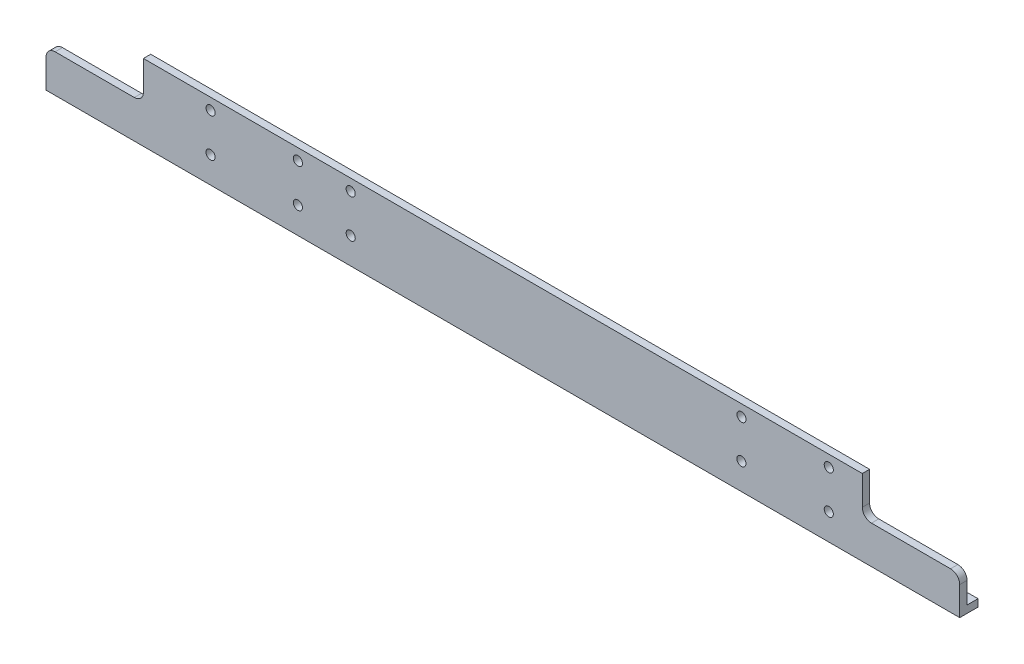
ISO-10303-21;
HEADER;
FILE_DESCRIPTION(('STEP AP214'),'2;1');
FILE_NAME('part.step','',(''),(''),'','','');
FILE_SCHEMA(('AUTOMOTIVE_DESIGN { 1 0 10303 214 1 1 1 1 }'));
ENDSEC;
DATA;
#1=APPLICATION_CONTEXT('core data for automotive mechanical design processes');
#2=APPLICATION_PROTOCOL_DEFINITION('international standard','automotive_design',2000,#1);
#3=PRODUCT_CONTEXT('',#1,'mechanical');
#4=PRODUCT('Part','Part','',(#3));
#5=PRODUCT_RELATED_PRODUCT_CATEGORY('part','',(#4));
#6=PRODUCT_DEFINITION_FORMATION('','',#4);
#7=PRODUCT_DEFINITION_CONTEXT('part definition',#1,'design');
#8=PRODUCT_DEFINITION('design','',#6,#7);
#9=PRODUCT_DEFINITION_SHAPE('','',#8);
#10=(LENGTH_UNIT() NAMED_UNIT(*) SI_UNIT(.MILLI.,.METRE.));
#11=(NAMED_UNIT(*) PLANE_ANGLE_UNIT() SI_UNIT($,.RADIAN.));
#12=(NAMED_UNIT(*) SI_UNIT($,.STERADIAN.) SOLID_ANGLE_UNIT());
#13=UNCERTAINTY_MEASURE_WITH_UNIT(LENGTH_MEASURE(1.E-05),#10,'distance_accuracy_value','');
#14=(GEOMETRIC_REPRESENTATION_CONTEXT(3) GLOBAL_UNCERTAINTY_ASSIGNED_CONTEXT((#13)) GLOBAL_UNIT_ASSIGNED_CONTEXT((#10,
#11,#12)) REPRESENTATION_CONTEXT('',''));
#15=CARTESIAN_POINT('',(0.,0.,0.));
#16=DIRECTION('',(0.,0.,1.));
#17=DIRECTION('',(1.,0.,0.));
#18=AXIS2_PLACEMENT_3D('',#15,#16,#17);
#19=CARTESIAN_POINT('',(-190.5,0.,0.));
#20=DIRECTION('',(-1.,0.,0.));
#21=DIRECTION('',(0.,0.,1.));
#22=AXIS2_PLACEMENT_3D('',#19,#20,#21);
#23=PLANE('',#22);
#24=DIRECTION('',(0.,-1.,0.));
#25=VECTOR('',#24,1.);
#26=CARTESIAN_POINT('',(-190.5,7.62,-7.62));
#27=LINE('',#26,#25);
#28=CARTESIAN_POINT('',(-190.5,3.048,-7.62));
#29=VERTEX_POINT('',#28);
#30=CARTESIAN_POINT('',(-190.5,0.,-7.62));
#31=VERTEX_POINT('',#30);
#32=EDGE_CURVE('E62',#29,#31,#27,.T.);
#33=ORIENTED_EDGE('',*,*,#32,.T.);
#34=DIRECTION('',(0.,0.,-1.));
#35=VECTOR('',#34,1.);
#36=CARTESIAN_POINT('',(-190.5,0.,0.));
#37=LINE('',#36,#35);
#38=CARTESIAN_POINT('',(-190.5,0.,0.));
#39=VERTEX_POINT('',#38);
#40=EDGE_CURVE('E175',#39,#31,#37,.T.);
#41=ORIENTED_EDGE('',*,*,#40,.F.);
#42=DIRECTION('',(0.,-1.,0.));
#43=VECTOR('',#42,1.);
#44=CARTESIAN_POINT('',(-190.5,0.,0.));
#45=LINE('',#44,#43);
#46=CARTESIAN_POINT('',(-190.5,11.938,0.));
#47=VERTEX_POINT('',#46);
#48=EDGE_CURVE('E173',#47,#39,#45,.T.);
#49=ORIENTED_EDGE('',*,*,#48,.F.);
#50=DIRECTION('',(0.,0.,1.));
#51=VECTOR('',#50,1.);
#52=CARTESIAN_POINT('',(-190.5,11.938,-31.75));
#53=LINE('',#52,#51);
#54=CARTESIAN_POINT('',(-190.5,11.938,-3.048));
#55=VERTEX_POINT('',#54);
#56=EDGE_CURVE('E213',#47,#55,#53,.F.);
#57=ORIENTED_EDGE('',*,*,#56,.T.);
#58=DIRECTION('',(0.,1.,0.));
#59=VECTOR('',#58,1.);
#60=CARTESIAN_POINT('',(-190.5,3.048,-3.048));
#61=LINE('',#60,#59);
#62=CARTESIAN_POINT('',(-190.5,3.048,-3.048));
#63=VERTEX_POINT('',#62);
#64=EDGE_CURVE('E181',#63,#55,#61,.T.);
#65=ORIENTED_EDGE('',*,*,#64,.F.);
#66=DIRECTION('',(0.,0.,1.));
#67=VECTOR('',#66,1.);
#68=CARTESIAN_POINT('',(-190.5,3.048,-3.048));
#69=LINE('',#68,#67);
#70=EDGE_CURVE('E179',#29,#63,#69,.T.);
#71=ORIENTED_EDGE('',*,*,#70,.F.);
#72=EDGE_LOOP('',(#33,#41,#49,#57,#65,#71));
#73=FACE_BOUND('',#72,.T.);
#74=ADVANCED_FACE('F46',(#73),#23,.T.);
#75=CARTESIAN_POINT('',(190.5,0.,0.));
#76=DIRECTION('',(-1.,0.,0.));
#77=DIRECTION('',(0.,0.,1.));
#78=AXIS2_PLACEMENT_3D('',#75,#76,#77);
#79=PLANE('',#78);
#80=DIRECTION('',(0.,0.,-1.));
#81=VECTOR('',#80,1.);
#82=CARTESIAN_POINT('',(190.5,0.,0.));
#83=LINE('',#82,#81);
#84=CARTESIAN_POINT('',(190.5,0.,0.));
#85=VERTEX_POINT('',#84);
#86=CARTESIAN_POINT('',(190.5,0.,-7.62));
#87=VERTEX_POINT('',#86);
#88=EDGE_CURVE('E159',#85,#87,#83,.T.);
#89=ORIENTED_EDGE('',*,*,#88,.T.);
#90=DIRECTION('',(0.,-1.,0.));
#91=VECTOR('',#90,1.);
#92=CARTESIAN_POINT('',(190.5,7.62,-7.62));
#93=LINE('',#92,#91);
#94=CARTESIAN_POINT('',(190.5,3.048,-7.62));
#95=VERTEX_POINT('',#94);
#96=EDGE_CURVE('E147',#95,#87,#93,.T.);
#97=ORIENTED_EDGE('',*,*,#96,.F.);
#98=DIRECTION('',(0.,0.,1.));
#99=VECTOR('',#98,1.);
#100=CARTESIAN_POINT('',(190.5,3.048,-3.048));
#101=LINE('',#100,#99);
#102=CARTESIAN_POINT('',(190.5,3.048,-3.048));
#103=VERTEX_POINT('',#102);
#104=EDGE_CURVE('E156',#95,#103,#101,.T.);
#105=ORIENTED_EDGE('',*,*,#104,.T.);
#106=DIRECTION('',(0.,1.,0.));
#107=VECTOR('',#106,1.);
#108=CARTESIAN_POINT('',(190.5,3.048,-3.048));
#109=LINE('',#108,#107);
#110=CARTESIAN_POINT('',(190.5,11.938,-3.048));
#111=VERTEX_POINT('',#110);
#112=EDGE_CURVE('E165',#103,#111,#109,.T.);
#113=ORIENTED_EDGE('',*,*,#112,.T.);
#114=DIRECTION('',(0.,0.,1.));
#115=VECTOR('',#114,1.);
#116=CARTESIAN_POINT('',(190.5,11.938,-31.75));
#117=LINE('',#116,#115);
#118=CARTESIAN_POINT('',(190.5,11.938,0.));
#119=VERTEX_POINT('',#118);
#120=EDGE_CURVE('E193',#119,#111,#117,.F.);
#121=ORIENTED_EDGE('',*,*,#120,.F.);
#122=DIRECTION('',(0.,-1.,0.));
#123=VECTOR('',#122,1.);
#124=CARTESIAN_POINT('',(190.5,0.,0.));
#125=LINE('',#124,#123);
#126=EDGE_CURVE('E169',#119,#85,#125,.T.);
#127=ORIENTED_EDGE('',*,*,#126,.T.);
#128=EDGE_LOOP('',(#89,#97,#105,#113,#121,#127));
#129=FACE_BOUND('',#128,.T.);
#130=ADVANCED_FACE('F154',(#129),#79,.F.);
#131=CARTESIAN_POINT('',(190.5,0.,0.));
#132=DIRECTION('',(0.,0.,-1.));
#133=DIRECTION('',(-1.,0.,0.));
#134=AXIS2_PLACEMENT_3D('',#131,#132,#133);
#135=PLANE('',#134);
#136=CARTESIAN_POINT('',(-63.4479999999987,27.,0.));
#137=DIRECTION('',(0.,0.,1.));
#138=DIRECTION('',(1.,0.,0.));
#139=AXIS2_PLACEMENT_3D('',#136,#137,#138);
#140=CIRCLE('',#139,1.89865);
#141=CARTESIAN_POINT('',(-61.5493499999987,27.,0.));
#142=VERTEX_POINT('',#141);
#143=EDGE_CURVE('E390',#142,#142,#140,.T.);
#144=ORIENTED_EDGE('',*,*,#143,.F.);
#145=EDGE_LOOP('',(#144));
#146=FACE_BOUND('',#145,.T.);
#147=CARTESIAN_POINT('',(-63.4479999999987,11.,0.));
#148=DIRECTION('',(0.,0.,1.));
#149=DIRECTION('',(1.,0.,0.));
#150=AXIS2_PLACEMENT_3D('',#147,#148,#149);
#151=CIRCLE('',#150,1.89865);
#152=CARTESIAN_POINT('',(-61.5493499999987,11.,0.));
#153=VERTEX_POINT('',#152);
#154=EDGE_CURVE('E394',#153,#153,#151,.T.);
#155=ORIENTED_EDGE('',*,*,#154,.F.);
#156=EDGE_LOOP('',(#155));
#157=FACE_BOUND('',#156,.T.);
#158=CARTESIAN_POINT('',(135.900000000001,27.,0.));
#159=DIRECTION('',(0.,0.,1.));
#160=DIRECTION('',(1.,0.,0.));
#161=AXIS2_PLACEMENT_3D('',#158,#159,#160);
#162=CIRCLE('',#161,1.89864999999997);
#163=CARTESIAN_POINT('',(137.798650000001,27.,0.));
#164=VERTEX_POINT('',#163);
#165=EDGE_CURVE('E273',#164,#164,#162,.T.);
#166=ORIENTED_EDGE('',*,*,#165,.F.);
#167=EDGE_LOOP('',(#166));
#168=FACE_BOUND('',#167,.T.);
#169=CARTESIAN_POINT('',(135.900000000001,11.,0.));
#170=DIRECTION('',(0.,0.,1.));
#171=DIRECTION('',(1.,0.,0.));
#172=AXIS2_PLACEMENT_3D('',#169,#170,#171);
#173=CIRCLE('',#172,1.89864999999997);
#174=CARTESIAN_POINT('',(137.798650000001,11.,0.));
#175=VERTEX_POINT('',#174);
#176=EDGE_CURVE('E202',#175,#175,#173,.T.);
#177=ORIENTED_EDGE('',*,*,#176,.F.);
#178=EDGE_LOOP('',(#177));
#179=FACE_BOUND('',#178,.T.);
#180=CARTESIAN_POINT('',(99.5,27.,0.));
#181=DIRECTION('',(0.,0.,1.));
#182=DIRECTION('',(1.,0.,0.));
#183=AXIS2_PLACEMENT_3D('',#180,#181,#182);
#184=CIRCLE('',#183,1.89864999999999);
#185=CARTESIAN_POINT('',(101.39865,27.,0.));
#186=VERTEX_POINT('',#185);
#187=EDGE_CURVE('E198',#186,#186,#184,.T.);
#188=ORIENTED_EDGE('',*,*,#187,.F.);
#189=EDGE_LOOP('',(#188));
#190=FACE_BOUND('',#189,.T.);
#191=CARTESIAN_POINT('',(99.468,11.0000000000001,0.));
#192=DIRECTION('',(0.,0.,1.));
#193=DIRECTION('',(1.,0.,0.));
#194=AXIS2_PLACEMENT_3D('',#191,#192,#193);
#195=CIRCLE('',#194,1.89864999999999);
#196=CARTESIAN_POINT('',(101.36665,11.0000000000001,0.));
#197=VERTEX_POINT('',#196);
#198=EDGE_CURVE('E197',#197,#197,#195,.T.);
#199=ORIENTED_EDGE('',*,*,#198,.F.);
#200=EDGE_LOOP('',(#199));
#201=FACE_BOUND('',#200,.T.);
#202=CARTESIAN_POINT('',(-121.867999999999,27.,0.));
#203=DIRECTION('',(0.,0.,1.));
#204=DIRECTION('',(1.,0.,0.));
#205=AXIS2_PLACEMENT_3D('',#202,#203,#204);
#206=CIRCLE('',#205,1.89864999999999);
#207=CARTESIAN_POINT('',(-119.969349999999,27.,0.));
#208=VERTEX_POINT('',#207);
#209=EDGE_CURVE('E288',#208,#208,#206,.T.);
#210=ORIENTED_EDGE('',*,*,#209,.F.);
#211=EDGE_LOOP('',(#210));
#212=FACE_BOUND('',#211,.T.);
#213=CARTESIAN_POINT('',(-121.867999999999,11.,0.));
#214=DIRECTION('',(0.,0.,1.));
#215=DIRECTION('',(1.,0.,0.));
#216=AXIS2_PLACEMENT_3D('',#213,#214,#215);
#217=CIRCLE('',#216,1.89864999999999);
#218=CARTESIAN_POINT('',(-119.969349999999,11.,0.));
#219=VERTEX_POINT('',#218);
#220=EDGE_CURVE('E294',#219,#219,#217,.T.);
#221=ORIENTED_EDGE('',*,*,#220,.F.);
#222=EDGE_LOOP('',(#221));
#223=FACE_BOUND('',#222,.T.);
#224=CARTESIAN_POINT('',(-85.468,11.,0.));
#225=DIRECTION('',(0.,0.,1.));
#226=DIRECTION('',(1.,0.,0.));
#227=AXIS2_PLACEMENT_3D('',#224,#225,#226);
#228=CIRCLE('',#227,1.89864999999999);
#229=CARTESIAN_POINT('',(-83.56935,11.,0.));
#230=VERTEX_POINT('',#229);
#231=EDGE_CURVE('E300',#230,#230,#228,.T.);
#232=ORIENTED_EDGE('',*,*,#231,.F.);
#233=EDGE_LOOP('',(#232));
#234=FACE_BOUND('',#233,.T.);
#235=CARTESIAN_POINT('',(-85.468,27.,0.));
#236=DIRECTION('',(0.,0.,1.));
#237=DIRECTION('',(1.,0.,0.));
#238=AXIS2_PLACEMENT_3D('',#235,#236,#237);
#239=CIRCLE('',#238,1.89864999999999);
#240=CARTESIAN_POINT('',(-83.56935,27.,0.));
#241=VERTEX_POINT('',#240);
#242=EDGE_CURVE('E306',#241,#241,#239,.T.);
#243=ORIENTED_EDGE('',*,*,#242,.F.);
#244=EDGE_LOOP('',(#243));
#245=FACE_BOUND('',#244,.T.);
#246=DIRECTION('',(1.,0.,0.));
#247=VECTOR('',#246,1.);
#248=CARTESIAN_POINT('',(-153.686999999998,15.748,0.));
#249=LINE('',#248,#247);
#250=CARTESIAN_POINT('',(-186.69,15.748,0.));
#251=VERTEX_POINT('',#250);
#252=CARTESIAN_POINT('',(-153.686999999998,15.748,0.));
#253=VERTEX_POINT('',#252);
#254=EDGE_CURVE('E239',#251,#253,#249,.T.);
#255=ORIENTED_EDGE('',*,*,#254,.F.);
#256=CARTESIAN_POINT('',(-186.69,11.938,0.));
#257=DIRECTION('',(0.,0.,-1.));
#258=DIRECTION('',(-1.,0.,0.));
#259=AXIS2_PLACEMENT_3D('',#256,#257,#258);
#260=CIRCLE('',#259,3.81);
#261=EDGE_CURVE('E322',#47,#251,#260,.T.);
#262=ORIENTED_EDGE('',*,*,#261,.F.);
#263=ORIENTED_EDGE('',*,*,#48,.T.);
#264=DIRECTION('',(-1.,0.,0.));
#265=VECTOR('',#264,1.);
#266=CARTESIAN_POINT('',(190.5,0.,0.));
#267=LINE('',#266,#265);
#268=EDGE_CURVE('E190',#85,#39,#267,.T.);
#269=ORIENTED_EDGE('',*,*,#268,.F.);
#270=ORIENTED_EDGE('',*,*,#126,.F.);
#271=CARTESIAN_POINT('',(186.69,11.938,0.));
#272=DIRECTION('',(0.,0.,-1.));
#273=DIRECTION('',(1.,0.,0.));
#274=AXIS2_PLACEMENT_3D('',#271,#272,#273);
#275=CIRCLE('',#274,3.81);
#276=CARTESIAN_POINT('',(186.69,15.748,0.));
#277=VERTEX_POINT('',#276);
#278=EDGE_CURVE('E250',#277,#119,#275,.T.);
#279=ORIENTED_EDGE('',*,*,#278,.F.);
#280=DIRECTION('',(1.,0.,0.));
#281=VECTOR('',#280,1.);
#282=CARTESIAN_POINT('',(153.686999999998,15.748,0.));
#283=LINE('',#282,#281);
#284=CARTESIAN_POINT('',(153.686999999998,15.748,0.));
#285=VERTEX_POINT('',#284);
#286=EDGE_CURVE('E258',#285,#277,#283,.T.);
#287=ORIENTED_EDGE('',*,*,#286,.F.);
#288=CARTESIAN_POINT('',(153.686999999998,19.558,0.));
#289=DIRECTION('',(0.,0.,1.));
#290=DIRECTION('',(1.,0.,0.));
#291=AXIS2_PLACEMENT_3D('',#288,#289,#290);
#292=CIRCLE('',#291,3.81);
#293=CARTESIAN_POINT('',(149.876999999998,19.558,0.));
#294=VERTEX_POINT('',#293);
#295=EDGE_CURVE('E255',#294,#285,#292,.T.);
#296=ORIENTED_EDGE('',*,*,#295,.F.);
#297=DIRECTION('',(0.,-1.,0.));
#298=VECTOR('',#297,1.);
#299=CARTESIAN_POINT('',(149.876999999998,41.148,0.));
#300=LINE('',#299,#298);
#301=CARTESIAN_POINT('',(149.876999999998,31.75,0.));
#302=VERTEX_POINT('',#301);
#303=EDGE_CURVE('E252',#302,#294,#300,.T.);
#304=ORIENTED_EDGE('',*,*,#303,.F.);
#305=DIRECTION('',(-1.,0.,0.));
#306=VECTOR('',#305,1.);
#307=CARTESIAN_POINT('',(190.5,31.75,0.));
#308=LINE('',#307,#306);
#309=CARTESIAN_POINT('',(-149.876999999998,31.75,0.));
#310=VERTEX_POINT('',#309);
#311=EDGE_CURVE('E167',#302,#310,#308,.T.);
#312=ORIENTED_EDGE('',*,*,#311,.T.);
#313=DIRECTION('',(0.,1.,0.));
#314=VECTOR('',#313,1.);
#315=CARTESIAN_POINT('',(-149.876999999998,41.148,0.));
#316=LINE('',#315,#314);
#317=CARTESIAN_POINT('',(-149.876999999998,19.558,0.));
#318=VERTEX_POINT('',#317);
#319=EDGE_CURVE('E244',#318,#310,#316,.T.);
#320=ORIENTED_EDGE('',*,*,#319,.F.);
#321=CARTESIAN_POINT('',(-153.686999999998,19.558,0.));
#322=DIRECTION('',(0.,0.,1.));
#323=DIRECTION('',(-1.,0.,0.));
#324=AXIS2_PLACEMENT_3D('',#321,#322,#323);
#325=CIRCLE('',#324,3.81);
#326=EDGE_CURVE('E331',#253,#318,#325,.T.);
#327=ORIENTED_EDGE('',*,*,#326,.F.);
#328=EDGE_LOOP('',(#255,#262,#263,#269,#270,#279,#287,#296,#304,#312,#320,#327));
#329=FACE_BOUND('',#328,.T.);
#330=ADVANCED_FACE('F48',(#146,#157,#168,#179,#190,#201,#212,#223,#234,#245,#329),#135,.F.);
#331=CARTESIAN_POINT('',(190.5,0.,0.));
#332=DIRECTION('',(0.,1.,0.));
#333=DIRECTION('',(0.,0.,1.));
#334=AXIS2_PLACEMENT_3D('',#331,#332,#333);
#335=PLANE('',#334);
#336=ORIENTED_EDGE('',*,*,#40,.T.);
#337=DIRECTION('',(1.,0.,0.));
#338=VECTOR('',#337,1.);
#339=CARTESIAN_POINT('',(190.5,0.,-7.62));
#340=LINE('',#339,#338);
#341=EDGE_CURVE('E317',#31,#87,#340,.T.);
#342=ORIENTED_EDGE('',*,*,#341,.T.);
#343=ORIENTED_EDGE('',*,*,#88,.F.);
#344=ORIENTED_EDGE('',*,*,#268,.T.);
#345=EDGE_LOOP('',(#336,#342,#343,#344));
#346=FACE_BOUND('',#345,.T.);
#347=ADVANCED_FACE('F316',(#346),#335,.F.);
#348=CARTESIAN_POINT('',(190.5,3.048,-3.048));
#349=DIRECTION('',(0.,-1.,0.));
#350=DIRECTION('',(0.,0.,-1.));
#351=AXIS2_PLACEMENT_3D('',#348,#349,#350);
#352=PLANE('',#351);
#353=ORIENTED_EDGE('',*,*,#104,.F.);
#354=DIRECTION('',(-1.,0.,0.));
#355=VECTOR('',#354,1.);
#356=CARTESIAN_POINT('',(190.5,3.048,-7.62));
#357=LINE('',#356,#355);
#358=EDGE_CURVE('E13',#95,#29,#357,.T.);
#359=ORIENTED_EDGE('',*,*,#358,.T.);
#360=ORIENTED_EDGE('',*,*,#70,.T.);
#361=DIRECTION('',(-1.,0.,0.));
#362=VECTOR('',#361,1.);
#363=CARTESIAN_POINT('',(190.5,3.048,-3.048));
#364=LINE('',#363,#362);
#365=EDGE_CURVE('E163',#103,#63,#364,.T.);
#366=ORIENTED_EDGE('',*,*,#365,.F.);
#367=EDGE_LOOP('',(#353,#359,#360,#366));
#368=FACE_BOUND('',#367,.T.);
#369=ADVANCED_FACE('F161',(#368),#352,.F.);
#370=CARTESIAN_POINT('',(190.5,3.048,-3.048));
#371=DIRECTION('',(0.,0.,1.));
#372=DIRECTION('',(1.,0.,0.));
#373=AXIS2_PLACEMENT_3D('',#370,#371,#372);
#374=PLANE('',#373);
#375=CARTESIAN_POINT('',(-63.4479999999987,27.,-3.048));
#376=DIRECTION('',(0.,0.,1.));
#377=DIRECTION('',(1.,0.,0.));
#378=AXIS2_PLACEMENT_3D('',#375,#376,#377);
#379=CIRCLE('',#378,1.89865);
#380=CARTESIAN_POINT('',(-61.5493499999987,27.,-3.048));
#381=VERTEX_POINT('',#380);
#382=EDGE_CURVE('E543',#381,#381,#379,.T.);
#383=ORIENTED_EDGE('',*,*,#382,.T.);
#384=EDGE_LOOP('',(#383));
#385=FACE_BOUND('',#384,.T.);
#386=CARTESIAN_POINT('',(-63.4479999999987,11.,-3.048));
#387=DIRECTION('',(0.,0.,1.));
#388=DIRECTION('',(1.,0.,0.));
#389=AXIS2_PLACEMENT_3D('',#386,#387,#388);
#390=CIRCLE('',#389,1.89865);
#391=CARTESIAN_POINT('',(-61.5493499999987,11.,-3.048));
#392=VERTEX_POINT('',#391);
#393=EDGE_CURVE('E50',#392,#392,#390,.T.);
#394=ORIENTED_EDGE('',*,*,#393,.T.);
#395=EDGE_LOOP('',(#394));
#396=FACE_BOUND('',#395,.T.);
#397=ORIENTED_EDGE('',*,*,#64,.T.);
#398=CARTESIAN_POINT('',(-186.69,11.938,-3.048));
#399=DIRECTION('',(0.,0.,1.));
#400=DIRECTION('',(1.,0.,0.));
#401=AXIS2_PLACEMENT_3D('',#398,#399,#400);
#402=CIRCLE('',#401,3.81);
#403=CARTESIAN_POINT('',(-186.69,15.748,-3.048));
#404=VERTEX_POINT('',#403);
#405=EDGE_CURVE('E69',#55,#404,#402,.F.);
#406=ORIENTED_EDGE('',*,*,#405,.T.);
#407=DIRECTION('',(1.,0.,0.));
#408=VECTOR('',#407,1.);
#409=CARTESIAN_POINT('',(190.5,15.7479999999999,-3.048));
#410=LINE('',#409,#408);
#411=CARTESIAN_POINT('',(-153.686999999998,15.748,-3.048));
#412=VERTEX_POINT('',#411);
#413=EDGE_CURVE('E218',#404,#412,#410,.T.);
#414=ORIENTED_EDGE('',*,*,#413,.T.);
#415=CARTESIAN_POINT('',(-153.686999999998,19.558,-3.048));
#416=DIRECTION('',(0.,0.,1.));
#417=DIRECTION('',(1.,0.,0.));
#418=AXIS2_PLACEMENT_3D('',#415,#416,#417);
#419=CIRCLE('',#418,3.81);
#420=CARTESIAN_POINT('',(-149.876999999998,19.558,-3.048));
#421=VERTEX_POINT('',#420);
#422=EDGE_CURVE('E55',#412,#421,#419,.T.);
#423=ORIENTED_EDGE('',*,*,#422,.T.);
#424=DIRECTION('',(0.,1.,0.));
#425=VECTOR('',#424,1.);
#426=CARTESIAN_POINT('',(-149.876999999998,3.048,-3.048));
#427=LINE('',#426,#425);
#428=CARTESIAN_POINT('',(-149.876999999998,31.75,-3.048));
#429=VERTEX_POINT('',#428);
#430=EDGE_CURVE('E227',#421,#429,#427,.T.);
#431=ORIENTED_EDGE('',*,*,#430,.T.);
#432=DIRECTION('',(-1.,0.,0.));
#433=VECTOR('',#432,1.);
#434=CARTESIAN_POINT('',(190.5,31.75,-3.048));
#435=LINE('',#434,#433);
#436=CARTESIAN_POINT('',(149.876999999998,31.75,-3.048));
#437=VERTEX_POINT('',#436);
#438=EDGE_CURVE('E186',#437,#429,#435,.T.);
#439=ORIENTED_EDGE('',*,*,#438,.F.);
#440=DIRECTION('',(0.,-1.,0.));
#441=VECTOR('',#440,1.);
#442=CARTESIAN_POINT('',(149.876999999998,3.048,-3.048));
#443=LINE('',#442,#441);
#444=CARTESIAN_POINT('',(149.876999999998,19.558,-3.048));
#445=VERTEX_POINT('',#444);
#446=EDGE_CURVE('E270',#437,#445,#443,.T.);
#447=ORIENTED_EDGE('',*,*,#446,.T.);
#448=CARTESIAN_POINT('',(153.686999999998,19.558,-3.048));
#449=DIRECTION('',(0.,0.,1.));
#450=DIRECTION('',(1.,0.,0.));
#451=AXIS2_PLACEMENT_3D('',#448,#449,#450);
#452=CIRCLE('',#451,3.81);
#453=CARTESIAN_POINT('',(153.686999999998,15.748,-3.048));
#454=VERTEX_POINT('',#453);
#455=EDGE_CURVE('E207',#445,#454,#452,.T.);
#456=ORIENTED_EDGE('',*,*,#455,.T.);
#457=DIRECTION('',(1.,0.,0.));
#458=VECTOR('',#457,1.);
#459=CARTESIAN_POINT('',(190.5,15.748,-3.048));
#460=LINE('',#459,#458);
#461=CARTESIAN_POINT('',(186.69,15.748,-3.048));
#462=VERTEX_POINT('',#461);
#463=EDGE_CURVE('E210',#454,#462,#460,.T.);
#464=ORIENTED_EDGE('',*,*,#463,.T.);
#465=CARTESIAN_POINT('',(186.69,11.938,-3.048));
#466=DIRECTION('',(0.,0.,1.));
#467=DIRECTION('',(1.,0.,0.));
#468=AXIS2_PLACEMENT_3D('',#465,#466,#467);
#469=CIRCLE('',#468,3.81);
#470=EDGE_CURVE('E264',#462,#111,#469,.F.);
#471=ORIENTED_EDGE('',*,*,#470,.T.);
#472=ORIENTED_EDGE('',*,*,#112,.F.);
#473=ORIENTED_EDGE('',*,*,#365,.T.);
#474=EDGE_LOOP('',(#397,#406,#414,#423,#431,#439,#447,#456,#464,#471,#472,#473));
#475=FACE_BOUND('',#474,.T.);
#476=CARTESIAN_POINT('',(135.900000000001,27.,-3.048));
#477=DIRECTION('',(0.,0.,1.));
#478=DIRECTION('',(1.,0.,0.));
#479=AXIS2_PLACEMENT_3D('',#476,#477,#478);
#480=CIRCLE('',#479,1.89864999999999);
#481=CARTESIAN_POINT('',(137.798650000001,27.,-3.048));
#482=VERTEX_POINT('',#481);
#483=EDGE_CURVE('E276',#482,#482,#480,.T.);
#484=ORIENTED_EDGE('',*,*,#483,.T.);
#485=EDGE_LOOP('',(#484));
#486=FACE_BOUND('',#485,.T.);
#487=CARTESIAN_POINT('',(135.900000000001,11.,-3.048));
#488=DIRECTION('',(0.,0.,1.));
#489=DIRECTION('',(1.,0.,0.));
#490=AXIS2_PLACEMENT_3D('',#487,#488,#489);
#491=CIRCLE('',#490,1.89864999999999);
#492=CARTESIAN_POINT('',(137.798650000001,11.,-3.048));
#493=VERTEX_POINT('',#492);
#494=EDGE_CURVE('E199',#493,#493,#491,.T.);
#495=ORIENTED_EDGE('',*,*,#494,.T.);
#496=EDGE_LOOP('',(#495));
#497=FACE_BOUND('',#496,.T.);
#498=CARTESIAN_POINT('',(99.5,27.,-3.048));
#499=DIRECTION('',(0.,0.,1.));
#500=DIRECTION('',(1.,0.,0.));
#501=AXIS2_PLACEMENT_3D('',#498,#499,#500);
#502=CIRCLE('',#501,1.89864999999999);
#503=CARTESIAN_POINT('',(101.39865,27.,-3.048));
#504=VERTEX_POINT('',#503);
#505=EDGE_CURVE('E194',#504,#504,#502,.T.);
#506=ORIENTED_EDGE('',*,*,#505,.T.);
#507=EDGE_LOOP('',(#506));
#508=FACE_BOUND('',#507,.T.);
#509=CARTESIAN_POINT('',(99.468,11.0000000000001,-3.048));
#510=DIRECTION('',(0.,0.,1.));
#511=DIRECTION('',(1.,0.,0.));
#512=AXIS2_PLACEMENT_3D('',#509,#510,#511);
#513=CIRCLE('',#512,1.89864999999999);
#514=CARTESIAN_POINT('',(101.36665,11.0000000000001,-3.048));
#515=VERTEX_POINT('',#514);
#516=EDGE_CURVE('E285',#515,#515,#513,.T.);
#517=ORIENTED_EDGE('',*,*,#516,.T.);
#518=EDGE_LOOP('',(#517));
#519=FACE_BOUND('',#518,.T.);
#520=CARTESIAN_POINT('',(-121.867999999999,27.,-3.048));
#521=DIRECTION('',(0.,0.,1.));
#522=DIRECTION('',(1.,0.,0.));
#523=AXIS2_PLACEMENT_3D('',#520,#521,#522);
#524=CIRCLE('',#523,1.89864999999999);
#525=CARTESIAN_POINT('',(-119.969349999999,27.,-3.048));
#526=VERTEX_POINT('',#525);
#527=EDGE_CURVE('E291',#526,#526,#524,.T.);
#528=ORIENTED_EDGE('',*,*,#527,.T.);
#529=EDGE_LOOP('',(#528));
#530=FACE_BOUND('',#529,.T.);
#531=CARTESIAN_POINT('',(-121.867999999999,11.,-3.048));
#532=DIRECTION('',(0.,0.,1.));
#533=DIRECTION('',(1.,0.,0.));
#534=AXIS2_PLACEMENT_3D('',#531,#532,#533);
#535=CIRCLE('',#534,1.89864999999999);
#536=CARTESIAN_POINT('',(-119.969349999999,11.,-3.048));
#537=VERTEX_POINT('',#536);
#538=EDGE_CURVE('E297',#537,#537,#535,.T.);
#539=ORIENTED_EDGE('',*,*,#538,.T.);
#540=EDGE_LOOP('',(#539));
#541=FACE_BOUND('',#540,.T.);
#542=CARTESIAN_POINT('',(-85.468,11.,-3.048));
#543=DIRECTION('',(0.,0.,1.));
#544=DIRECTION('',(1.,0.,0.));
#545=AXIS2_PLACEMENT_3D('',#542,#543,#544);
#546=CIRCLE('',#545,1.89864999999999);
#547=CARTESIAN_POINT('',(-83.56935,11.,-3.048));
#548=VERTEX_POINT('',#547);
#549=EDGE_CURVE('E303',#548,#548,#546,.T.);
#550=ORIENTED_EDGE('',*,*,#549,.T.);
#551=EDGE_LOOP('',(#550));
#552=FACE_BOUND('',#551,.T.);
#553=CARTESIAN_POINT('',(-85.468,27.,-3.048));
#554=DIRECTION('',(0.,0.,1.));
#555=DIRECTION('',(1.,0.,0.));
#556=AXIS2_PLACEMENT_3D('',#553,#554,#555);
#557=CIRCLE('',#556,1.89864999999999);
#558=CARTESIAN_POINT('',(-83.56935,27.,-3.048));
#559=VERTEX_POINT('',#558);
#560=EDGE_CURVE('E176',#559,#559,#557,.T.);
#561=ORIENTED_EDGE('',*,*,#560,.T.);
#562=EDGE_LOOP('',(#561));
#563=FACE_BOUND('',#562,.T.);
#564=ADVANCED_FACE('F224',(#385,#396,#475,#486,#497,#508,#519,#530,#541,#552,#563),#374,.F.);
#565=CARTESIAN_POINT('',(190.5,31.75,0.));
#566=DIRECTION('',(0.,-1.,0.));
#567=DIRECTION('',(0.,0.,-1.));
#568=AXIS2_PLACEMENT_3D('',#565,#566,#567);
#569=PLANE('',#568);
#570=ORIENTED_EDGE('',*,*,#438,.T.);
#571=DIRECTION('',(0.,0.,1.));
#572=VECTOR('',#571,1.);
#573=CARTESIAN_POINT('',(-149.876999999998,31.75,0.));
#574=LINE('',#573,#572);
#575=EDGE_CURVE('E215',#429,#310,#574,.T.);
#576=ORIENTED_EDGE('',*,*,#575,.T.);
#577=ORIENTED_EDGE('',*,*,#311,.F.);
#578=DIRECTION('',(0.,0.,-1.));
#579=VECTOR('',#578,1.);
#580=CARTESIAN_POINT('',(149.876999999998,31.75,0.));
#581=LINE('',#580,#579);
#582=EDGE_CURVE('E204',#302,#437,#581,.T.);
#583=ORIENTED_EDGE('',*,*,#582,.T.);
#584=EDGE_LOOP('',(#570,#576,#577,#583));
#585=FACE_BOUND('',#584,.T.);
#586=ADVANCED_FACE('F337',(#585),#569,.F.);
#587=CARTESIAN_POINT('',(-85.468,27.,0.));
#588=DIRECTION('',(0.,0.,1.));
#589=DIRECTION('',(1.,0.,0.));
#590=AXIS2_PLACEMENT_3D('',#587,#588,#589);
#591=CYLINDRICAL_SURFACE('',#590,1.89864999999999);
#592=ORIENTED_EDGE('',*,*,#242,.T.);
#593=EDGE_LOOP('',(#592));
#594=FACE_BOUND('',#593,.T.);
#595=ORIENTED_EDGE('',*,*,#560,.F.);
#596=EDGE_LOOP('',(#595));
#597=FACE_BOUND('',#596,.T.);
#598=ADVANCED_FACE('F374',(#594,#597),#591,.F.);
#599=CARTESIAN_POINT('',(-85.468,11.,0.));
#600=DIRECTION('',(0.,0.,1.));
#601=DIRECTION('',(1.,0.,0.));
#602=AXIS2_PLACEMENT_3D('',#599,#600,#601);
#603=CYLINDRICAL_SURFACE('',#602,1.89864999999999);
#604=ORIENTED_EDGE('',*,*,#231,.T.);
#605=EDGE_LOOP('',(#604));
#606=FACE_BOUND('',#605,.T.);
#607=ORIENTED_EDGE('',*,*,#549,.F.);
#608=EDGE_LOOP('',(#607));
#609=FACE_BOUND('',#608,.T.);
#610=ADVANCED_FACE('F413',(#606,#609),#603,.F.);
#611=CARTESIAN_POINT('',(-121.867999999999,11.,0.));
#612=DIRECTION('',(0.,0.,1.));
#613=DIRECTION('',(1.,0.,0.));
#614=AXIS2_PLACEMENT_3D('',#611,#612,#613);
#615=CYLINDRICAL_SURFACE('',#614,1.89864999999999);
#616=ORIENTED_EDGE('',*,*,#220,.T.);
#617=EDGE_LOOP('',(#616));
#618=FACE_BOUND('',#617,.T.);
#619=ORIENTED_EDGE('',*,*,#538,.F.);
#620=EDGE_LOOP('',(#619));
#621=FACE_BOUND('',#620,.T.);
#622=ADVANCED_FACE('F419',(#618,#621),#615,.F.);
#623=CARTESIAN_POINT('',(-121.867999999999,27.,0.));
#624=DIRECTION('',(0.,0.,1.));
#625=DIRECTION('',(1.,0.,0.));
#626=AXIS2_PLACEMENT_3D('',#623,#624,#625);
#627=CYLINDRICAL_SURFACE('',#626,1.89864999999999);
#628=ORIENTED_EDGE('',*,*,#209,.T.);
#629=EDGE_LOOP('',(#628));
#630=FACE_BOUND('',#629,.T.);
#631=ORIENTED_EDGE('',*,*,#527,.F.);
#632=EDGE_LOOP('',(#631));
#633=FACE_BOUND('',#632,.T.);
#634=ADVANCED_FACE('F425',(#630,#633),#627,.F.);
#635=CARTESIAN_POINT('',(99.468,11.0000000000001,0.));
#636=DIRECTION('',(0.,0.,1.));
#637=DIRECTION('',(1.,0.,0.));
#638=AXIS2_PLACEMENT_3D('',#635,#636,#637);
#639=CYLINDRICAL_SURFACE('',#638,1.89864999999999);
#640=ORIENTED_EDGE('',*,*,#198,.T.);
#641=EDGE_LOOP('',(#640));
#642=FACE_BOUND('',#641,.T.);
#643=ORIENTED_EDGE('',*,*,#516,.F.);
#644=EDGE_LOOP('',(#643));
#645=FACE_BOUND('',#644,.T.);
#646=ADVANCED_FACE('F429',(#642,#645),#639,.F.);
#647=CARTESIAN_POINT('',(99.5,27.,0.));
#648=DIRECTION('',(0.,0.,1.));
#649=DIRECTION('',(1.,0.,0.));
#650=AXIS2_PLACEMENT_3D('',#647,#648,#649);
#651=CYLINDRICAL_SURFACE('',#650,1.89864999999999);
#652=ORIENTED_EDGE('',*,*,#187,.T.);
#653=EDGE_LOOP('',(#652));
#654=FACE_BOUND('',#653,.T.);
#655=ORIENTED_EDGE('',*,*,#505,.F.);
#656=EDGE_LOOP('',(#655));
#657=FACE_BOUND('',#656,.T.);
#658=ADVANCED_FACE('F433',(#654,#657),#651,.F.);
#659=CARTESIAN_POINT('',(135.900000000001,11.,0.));
#660=DIRECTION('',(0.,0.,1.));
#661=DIRECTION('',(1.,0.,0.));
#662=AXIS2_PLACEMENT_3D('',#659,#660,#661);
#663=CYLINDRICAL_SURFACE('',#662,1.89864999999999);
#664=ORIENTED_EDGE('',*,*,#176,.T.);
#665=EDGE_LOOP('',(#664));
#666=FACE_BOUND('',#665,.T.);
#667=ORIENTED_EDGE('',*,*,#494,.F.);
#668=EDGE_LOOP('',(#667));
#669=FACE_BOUND('',#668,.T.);
#670=ADVANCED_FACE('F437',(#666,#669),#663,.F.);
#671=CARTESIAN_POINT('',(135.900000000001,27.,0.));
#672=DIRECTION('',(0.,0.,1.));
#673=DIRECTION('',(1.,0.,0.));
#674=AXIS2_PLACEMENT_3D('',#671,#672,#673);
#675=CYLINDRICAL_SURFACE('',#674,1.89864999999999);
#676=ORIENTED_EDGE('',*,*,#165,.T.);
#677=EDGE_LOOP('',(#676));
#678=FACE_BOUND('',#677,.T.);
#679=ORIENTED_EDGE('',*,*,#483,.F.);
#680=EDGE_LOOP('',(#679));
#681=FACE_BOUND('',#680,.T.);
#682=ADVANCED_FACE('F441',(#678,#681),#675,.F.);
#683=CARTESIAN_POINT('',(153.686999999998,15.748,-31.75));
#684=DIRECTION('',(0.,-1.,0.));
#685=DIRECTION('',(1.,0.,0.));
#686=AXIS2_PLACEMENT_3D('',#683,#684,#685);
#687=PLANE('',#686);
#688=DIRECTION('',(0.,0.,1.));
#689=VECTOR('',#688,1.);
#690=CARTESIAN_POINT('',(153.686999999998,15.748,-31.75));
#691=LINE('',#690,#689);
#692=EDGE_CURVE('E265',#454,#285,#691,.T.);
#693=ORIENTED_EDGE('',*,*,#692,.T.);
#694=ORIENTED_EDGE('',*,*,#286,.T.);
#695=DIRECTION('',(0.,0.,1.));
#696=VECTOR('',#695,1.);
#697=CARTESIAN_POINT('',(186.69,15.748,-31.75));
#698=LINE('',#697,#696);
#699=EDGE_CURVE('E262',#462,#277,#698,.T.);
#700=ORIENTED_EDGE('',*,*,#699,.F.);
#701=ORIENTED_EDGE('',*,*,#463,.F.);
#702=EDGE_LOOP('',(#693,#694,#700,#701));
#703=FACE_BOUND('',#702,.T.);
#704=ADVANCED_FACE('F348',(#703),#687,.F.);
#705=CARTESIAN_POINT('',(153.686999999998,19.558,-31.75));
#706=DIRECTION('',(0.,0.,1.));
#707=DIRECTION('',(1.,0.,0.));
#708=AXIS2_PLACEMENT_3D('',#705,#706,#707);
#709=CYLINDRICAL_SURFACE('',#708,3.81);
#710=DIRECTION('',(0.,0.,1.));
#711=VECTOR('',#710,1.);
#712=CARTESIAN_POINT('',(149.876999999998,19.558,-31.75));
#713=LINE('',#712,#711);
#714=EDGE_CURVE('E261',#445,#294,#713,.T.);
#715=ORIENTED_EDGE('',*,*,#714,.T.);
#716=ORIENTED_EDGE('',*,*,#295,.T.);
#717=ORIENTED_EDGE('',*,*,#692,.F.);
#718=ORIENTED_EDGE('',*,*,#455,.F.);
#719=EDGE_LOOP('',(#715,#716,#717,#718));
#720=FACE_BOUND('',#719,.T.);
#721=ADVANCED_FACE('F346',(#720),#709,.F.);
#722=CARTESIAN_POINT('',(149.876999999998,41.148,-31.75));
#723=DIRECTION('',(-1.,0.,0.));
#724=DIRECTION('',(0.,0.,1.));
#725=AXIS2_PLACEMENT_3D('',#722,#723,#724);
#726=PLANE('',#725);
#727=ORIENTED_EDGE('',*,*,#582,.F.);
#728=ORIENTED_EDGE('',*,*,#303,.T.);
#729=ORIENTED_EDGE('',*,*,#714,.F.);
#730=ORIENTED_EDGE('',*,*,#446,.F.);
#731=EDGE_LOOP('',(#727,#728,#729,#730));
#732=FACE_BOUND('',#731,.T.);
#733=ADVANCED_FACE('F343',(#732),#726,.F.);
#734=CARTESIAN_POINT('',(186.69,11.938,-31.75));
#735=DIRECTION('',(0.,0.,1.));
#736=DIRECTION('',(1.,0.,0.));
#737=AXIS2_PLACEMENT_3D('',#734,#735,#736);
#738=CYLINDRICAL_SURFACE('',#737,3.81);
#739=ORIENTED_EDGE('',*,*,#699,.T.);
#740=ORIENTED_EDGE('',*,*,#278,.T.);
#741=ORIENTED_EDGE('',*,*,#120,.T.);
#742=ORIENTED_EDGE('',*,*,#470,.F.);
#743=EDGE_LOOP('',(#739,#740,#741,#742));
#744=FACE_BOUND('',#743,.T.);
#745=ADVANCED_FACE('F351',(#744),#738,.T.);
#746=CARTESIAN_POINT('',(-153.686999999998,19.558,-31.75));
#747=DIRECTION('',(0.,0.,1.));
#748=DIRECTION('',(1.,0.,0.));
#749=AXIS2_PLACEMENT_3D('',#746,#747,#748);
#750=CYLINDRICAL_SURFACE('',#749,3.81);
#751=DIRECTION('',(0.,0.,1.));
#752=VECTOR('',#751,1.);
#753=CARTESIAN_POINT('',(-153.686999999998,15.748,-31.75));
#754=LINE('',#753,#752);
#755=EDGE_CURVE('E233',#412,#253,#754,.T.);
#756=ORIENTED_EDGE('',*,*,#755,.T.);
#757=ORIENTED_EDGE('',*,*,#326,.T.);
#758=DIRECTION('',(0.,0.,1.));
#759=VECTOR('',#758,1.);
#760=CARTESIAN_POINT('',(-149.876999999998,19.558,-31.75));
#761=LINE('',#760,#759);
#762=EDGE_CURVE('E235',#421,#318,#761,.T.);
#763=ORIENTED_EDGE('',*,*,#762,.F.);
#764=ORIENTED_EDGE('',*,*,#422,.F.);
#765=EDGE_LOOP('',(#756,#757,#763,#764));
#766=FACE_BOUND('',#765,.T.);
#767=ADVANCED_FACE('F231',(#766),#750,.F.);
#768=CARTESIAN_POINT('',(-153.686999999998,15.748,-31.75));
#769=DIRECTION('',(0.,-1.,0.));
#770=DIRECTION('',(1.,0.,0.));
#771=AXIS2_PLACEMENT_3D('',#768,#769,#770);
#772=PLANE('',#771);
#773=DIRECTION('',(0.,0.,1.));
#774=VECTOR('',#773,1.);
#775=CARTESIAN_POINT('',(-186.69,15.748,-31.75));
#776=LINE('',#775,#774);
#777=EDGE_CURVE('E241',#404,#251,#776,.T.);
#778=ORIENTED_EDGE('',*,*,#777,.T.);
#779=ORIENTED_EDGE('',*,*,#254,.T.);
#780=ORIENTED_EDGE('',*,*,#755,.F.);
#781=ORIENTED_EDGE('',*,*,#413,.F.);
#782=EDGE_LOOP('',(#778,#779,#780,#781));
#783=FACE_BOUND('',#782,.T.);
#784=ADVANCED_FACE('F237',(#783),#772,.F.);
#785=CARTESIAN_POINT('',(-149.876999999998,41.148,-31.75));
#786=DIRECTION('',(1.,0.,0.));
#787=DIRECTION('',(0.,0.,-1.));
#788=AXIS2_PLACEMENT_3D('',#785,#786,#787);
#789=PLANE('',#788);
#790=ORIENTED_EDGE('',*,*,#762,.T.);
#791=ORIENTED_EDGE('',*,*,#319,.T.);
#792=ORIENTED_EDGE('',*,*,#575,.F.);
#793=ORIENTED_EDGE('',*,*,#430,.F.);
#794=EDGE_LOOP('',(#790,#791,#792,#793));
#795=FACE_BOUND('',#794,.T.);
#796=ADVANCED_FACE('F334',(#795),#789,.F.);
#797=CARTESIAN_POINT('',(-186.69,11.938,-31.75));
#798=DIRECTION('',(0.,0.,1.));
#799=DIRECTION('',(1.,0.,0.));
#800=AXIS2_PLACEMENT_3D('',#797,#798,#799);
#801=CYLINDRICAL_SURFACE('',#800,3.81);
#802=ORIENTED_EDGE('',*,*,#56,.F.);
#803=ORIENTED_EDGE('',*,*,#261,.T.);
#804=ORIENTED_EDGE('',*,*,#777,.F.);
#805=ORIENTED_EDGE('',*,*,#405,.F.);
#806=EDGE_LOOP('',(#802,#803,#804,#805));
#807=FACE_BOUND('',#806,.T.);
#808=ADVANCED_FACE('F352',(#807),#801,.T.);
#809=CARTESIAN_POINT('',(-190.5,7.62,-7.62));
#810=DIRECTION('',(0.,0.,1.));
#811=DIRECTION('',(0.,-1.,0.));
#812=AXIS2_PLACEMENT_3D('',#809,#810,#811);
#813=PLANE('',#812);
#814=ORIENTED_EDGE('',*,*,#32,.F.);
#815=ORIENTED_EDGE('',*,*,#358,.F.);
#816=ORIENTED_EDGE('',*,*,#96,.T.);
#817=ORIENTED_EDGE('',*,*,#341,.F.);
#818=EDGE_LOOP('',(#814,#815,#816,#817));
#819=FACE_BOUND('',#818,.T.);
#820=ADVANCED_FACE('F146',(#819),#813,.F.);
#821=CARTESIAN_POINT('',(-63.4479999999987,11.,0.));
#822=DIRECTION('',(0.,0.,1.));
#823=DIRECTION('',(1.,0.,0.));
#824=AXIS2_PLACEMENT_3D('',#821,#822,#823);
#825=CYLINDRICAL_SURFACE('',#824,1.89865);
#826=ORIENTED_EDGE('',*,*,#154,.T.);
#827=EDGE_LOOP('',(#826));
#828=FACE_BOUND('',#827,.T.);
#829=ORIENTED_EDGE('',*,*,#393,.F.);
#830=EDGE_LOOP('',(#829));
#831=FACE_BOUND('',#830,.T.);
#832=ADVANCED_FACE('F359',(#828,#831),#825,.F.);
#833=CARTESIAN_POINT('',(-63.4479999999987,27.,0.));
#834=DIRECTION('',(0.,0.,1.));
#835=DIRECTION('',(1.,0.,0.));
#836=AXIS2_PLACEMENT_3D('',#833,#834,#835);
#837=CYLINDRICAL_SURFACE('',#836,1.89865);
#838=ORIENTED_EDGE('',*,*,#143,.T.);
#839=EDGE_LOOP('',(#838));
#840=FACE_BOUND('',#839,.T.);
#841=ORIENTED_EDGE('',*,*,#382,.F.);
#842=EDGE_LOOP('',(#841));
#843=FACE_BOUND('',#842,.T.);
#844=ADVANCED_FACE('F526',(#840,#843),#837,.F.);
#845=CLOSED_SHELL('',(#74,#130,#330,#347,#369,#564,#586,#598,#610,#622,#634,#646,#658,#670,#682,
#704,#721,#733,#745,#767,#784,#796,#808,#820,#832,#844));
#846=MANIFOLD_SOLID_BREP('B2',#845);
#847=ADVANCED_BREP_SHAPE_REPRESENTATION('',(#18,#846),#14);
#848=SHAPE_DEFINITION_REPRESENTATION(#9,#847);
ENDSEC;
END-ISO-10303-21;
